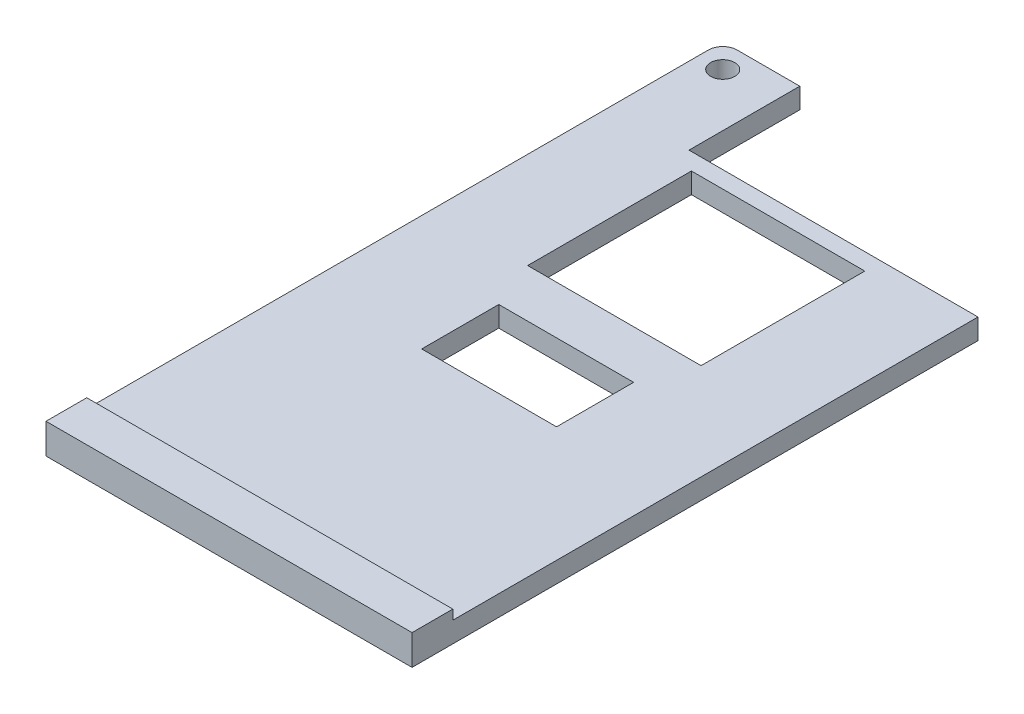
ISO-10303-21;
HEADER;
FILE_DESCRIPTION(('STEP AP214'),'2;1');
FILE_NAME('part.step','',(''),(''),'','','');
FILE_SCHEMA(('AUTOMOTIVE_DESIGN { 1 0 10303 214 1 1 1 1 }'));
ENDSEC;
DATA;
#1=APPLICATION_CONTEXT('core data for automotive mechanical design processes');
#2=APPLICATION_PROTOCOL_DEFINITION('international standard','automotive_design',2000,#1);
#3=PRODUCT_CONTEXT('',#1,'mechanical');
#4=PRODUCT('Part','Part','',(#3));
#5=PRODUCT_RELATED_PRODUCT_CATEGORY('part','',(#4));
#6=PRODUCT_DEFINITION_FORMATION('','',#4);
#7=PRODUCT_DEFINITION_CONTEXT('part definition',#1,'design');
#8=PRODUCT_DEFINITION('design','',#6,#7);
#9=PRODUCT_DEFINITION_SHAPE('','',#8);
#10=(LENGTH_UNIT() NAMED_UNIT(*) SI_UNIT(.MILLI.,.METRE.));
#11=(NAMED_UNIT(*) PLANE_ANGLE_UNIT() SI_UNIT($,.RADIAN.));
#12=(NAMED_UNIT(*) SI_UNIT($,.STERADIAN.) SOLID_ANGLE_UNIT());
#13=UNCERTAINTY_MEASURE_WITH_UNIT(LENGTH_MEASURE(1.E-05),#10,'distance_accuracy_value','');
#14=(GEOMETRIC_REPRESENTATION_CONTEXT(3) GLOBAL_UNCERTAINTY_ASSIGNED_CONTEXT((#13)) GLOBAL_UNIT_ASSIGNED_CONTEXT((#10,
#11,#12)) REPRESENTATION_CONTEXT('',''));
#15=CARTESIAN_POINT('',(0.,0.,0.));
#16=DIRECTION('',(0.,0.,1.));
#17=DIRECTION('',(1.,0.,0.));
#18=AXIS2_PLACEMENT_3D('',#15,#16,#17);
#19=CARTESIAN_POINT('',(36.5,2.13,-88.));
#20=DIRECTION('',(0.,-1.,0.));
#21=DIRECTION('',(0.,0.,-1.));
#22=AXIS2_PLACEMENT_3D('',#19,#20,#21);
#23=PLANE('',#22);
#24=CARTESIAN_POINT('',(2.5,2.13,-87.));
#25=DIRECTION('',(0.,1.,0.));
#26=DIRECTION('',(0.,0.,1.));
#27=AXIS2_PLACEMENT_3D('',#24,#25,#26);
#28=CIRCLE('',#27,1.25);
#29=CARTESIAN_POINT('',(2.5,2.13,-85.75));
#30=VERTEX_POINT('',#29);
#31=EDGE_CURVE('E251',#30,#30,#28,.T.);
#32=ORIENTED_EDGE('',*,*,#31,.F.);
#33=EDGE_LOOP('',(#32));
#34=FACE_BOUND('',#33,.T.);
#35=DIRECTION('',(0.,0.,1.));
#36=VECTOR('',#35,1.);
#37=CARTESIAN_POINT('',(12.,2.13,-46.25));
#38=LINE('',#37,#36);
#39=CARTESIAN_POINT('',(12.,2.13,-54.25));
#40=VERTEX_POINT('',#39);
#41=CARTESIAN_POINT('',(12.,2.13,-46.25));
#42=VERTEX_POINT('',#41);
#43=EDGE_CURVE('E257',#40,#42,#38,.T.);
#44=ORIENTED_EDGE('',*,*,#43,.F.);
#45=DIRECTION('',(-1.,0.,0.));
#46=VECTOR('',#45,1.);
#47=CARTESIAN_POINT('',(12.,2.13,-54.25));
#48=LINE('',#47,#46);
#49=CARTESIAN_POINT('',(26.,2.13,-54.25));
#50=VERTEX_POINT('',#49);
#51=EDGE_CURVE('E265',#50,#40,#48,.T.);
#52=ORIENTED_EDGE('',*,*,#51,.F.);
#53=DIRECTION('',(0.,0.,-1.));
#54=VECTOR('',#53,1.);
#55=CARTESIAN_POINT('',(26.,2.13,-54.25));
#56=LINE('',#55,#54);
#57=CARTESIAN_POINT('',(26.,2.13,-46.25));
#58=VERTEX_POINT('',#57);
#59=EDGE_CURVE('E262',#58,#50,#56,.T.);
#60=ORIENTED_EDGE('',*,*,#59,.F.);
#61=DIRECTION('',(1.,0.,0.));
#62=VECTOR('',#61,1.);
#63=CARTESIAN_POINT('',(26.,2.13,-46.25));
#64=LINE('',#63,#62);
#65=EDGE_CURVE('E259',#42,#58,#64,.T.);
#66=ORIENTED_EDGE('',*,*,#65,.F.);
#67=EDGE_LOOP('',(#44,#52,#60,#66));
#68=FACE_BOUND('',#67,.T.);
#69=DIRECTION('',(0.,0.,1.));
#70=VECTOR('',#69,1.);
#71=CARTESIAN_POINT('',(10.,2.13,-76.25));
#72=LINE('',#71,#70);
#73=CARTESIAN_POINT('',(10.,2.13,-76.25));
#74=VERTEX_POINT('',#73);
#75=CARTESIAN_POINT('',(10.,2.13,-59.25));
#76=VERTEX_POINT('',#75);
#77=EDGE_CURVE('E288',#74,#76,#72,.T.);
#78=ORIENTED_EDGE('',*,*,#77,.F.);
#79=DIRECTION('',(-1.,0.,0.));
#80=VECTOR('',#79,1.);
#81=CARTESIAN_POINT('',(10.,2.13,-76.25));
#82=LINE('',#81,#80);
#83=CARTESIAN_POINT('',(28.,2.13,-76.25));
#84=VERTEX_POINT('',#83);
#85=EDGE_CURVE('E296',#84,#74,#82,.T.);
#86=ORIENTED_EDGE('',*,*,#85,.F.);
#87=DIRECTION('',(0.,0.,-1.));
#88=VECTOR('',#87,1.);
#89=CARTESIAN_POINT('',(28.,2.13,-76.25));
#90=LINE('',#89,#88);
#91=CARTESIAN_POINT('',(28.,2.13,-59.25));
#92=VERTEX_POINT('',#91);
#93=EDGE_CURVE('E293',#92,#84,#90,.T.);
#94=ORIENTED_EDGE('',*,*,#93,.F.);
#95=DIRECTION('',(1.,0.,0.));
#96=VECTOR('',#95,1.);
#97=CARTESIAN_POINT('',(28.,2.13,-59.25));
#98=LINE('',#97,#96);
#99=EDGE_CURVE('E290',#76,#92,#98,.T.);
#100=ORIENTED_EDGE('',*,*,#99,.F.);
#101=EDGE_LOOP('',(#78,#86,#94,#100));
#102=FACE_BOUND('',#101,.T.);
#103=DIRECTION('',(0.,0.,-1.));
#104=VECTOR('',#103,1.);
#105=CARTESIAN_POINT('',(38.,2.13,-19.25));
#106=LINE('',#105,#104);
#107=CARTESIAN_POINT('',(38.,2.13,-23.48));
#108=VERTEX_POINT('',#107);
#109=CARTESIAN_POINT('',(38.,2.13,-78.));
#110=VERTEX_POINT('',#109);
#111=EDGE_CURVE('E196',#108,#110,#106,.T.);
#112=ORIENTED_EDGE('',*,*,#111,.T.);
#113=DIRECTION('',(-1.,0.,0.));
#114=VECTOR('',#113,1.);
#115=CARTESIAN_POINT('',(8.,2.13,-78.));
#116=LINE('',#115,#114);
#117=CARTESIAN_POINT('',(8.,2.13,-78.));
#118=VERTEX_POINT('',#117);
#119=EDGE_CURVE('E63',#110,#118,#116,.T.);
#120=ORIENTED_EDGE('',*,*,#119,.T.);
#121=DIRECTION('',(0.,0.,-1.));
#122=VECTOR('',#121,1.);
#123=CARTESIAN_POINT('',(8.,2.13,-89.5));
#124=LINE('',#123,#122);
#125=CARTESIAN_POINT('',(8.,2.13,-89.5));
#126=VERTEX_POINT('',#125);
#127=EDGE_CURVE('E188',#118,#126,#124,.T.);
#128=ORIENTED_EDGE('',*,*,#127,.T.);
#129=DIRECTION('',(-1.,0.,0.));
#130=VECTOR('',#129,1.);
#131=CARTESIAN_POINT('',(1.50000000000001,2.13,-89.5));
#132=LINE('',#131,#130);
#133=CARTESIAN_POINT('',(1.50000000000001,2.13,-89.5));
#134=VERTEX_POINT('',#133);
#135=EDGE_CURVE('E211',#126,#134,#132,.T.);
#136=ORIENTED_EDGE('',*,*,#135,.T.);
#137=CARTESIAN_POINT('',(1.5,2.13,-88.));
#138=DIRECTION('',(0.,1.,0.));
#139=DIRECTION('',(0.,0.,-1.));
#140=AXIS2_PLACEMENT_3D('',#137,#138,#139);
#141=CIRCLE('',#140,1.5);
#142=CARTESIAN_POINT('',(0.,2.13,-88.));
#143=VERTEX_POINT('',#142);
#144=EDGE_CURVE('E319',#134,#143,#141,.T.);
#145=ORIENTED_EDGE('',*,*,#144,.T.);
#146=DIRECTION('',(0.,0.,1.));
#147=VECTOR('',#146,1.);
#148=CARTESIAN_POINT('',(0.,2.13,-19.25));
#149=LINE('',#148,#147);
#150=CARTESIAN_POINT('',(0.,2.13,-23.48));
#151=VERTEX_POINT('',#150);
#152=EDGE_CURVE('E321',#143,#151,#149,.T.);
#153=ORIENTED_EDGE('',*,*,#152,.T.);
#154=DIRECTION('',(-1.,0.,0.));
#155=VECTOR('',#154,1.);
#156=CARTESIAN_POINT('',(0.,2.13,-23.48));
#157=LINE('',#156,#155);
#158=EDGE_CURVE('E71',#108,#151,#157,.T.);
#159=ORIENTED_EDGE('',*,*,#158,.F.);
#160=EDGE_LOOP('',(#112,#120,#128,#136,#145,#153,#159));
#161=FACE_BOUND('',#160,.T.);
#162=ADVANCED_FACE('F48',(#34,#68,#102,#161),#23,.F.);
#163=CARTESIAN_POINT('',(36.5,0.,-88.));
#164=DIRECTION('',(0.,-1.,0.));
#165=DIRECTION('',(0.,0.,-1.));
#166=AXIS2_PLACEMENT_3D('',#163,#164,#165);
#167=PLANE('',#166);
#168=DIRECTION('',(-1.,0.,0.));
#169=VECTOR('',#168,1.);
#170=CARTESIAN_POINT('',(8.,0.,-78.));
#171=LINE('',#170,#169);
#172=CARTESIAN_POINT('',(38.,0.,-78.));
#173=VERTEX_POINT('',#172);
#174=CARTESIAN_POINT('',(8.,0.,-78.));
#175=VERTEX_POINT('',#174);
#176=EDGE_CURVE('E169',#173,#175,#171,.T.);
#177=ORIENTED_EDGE('',*,*,#176,.F.);
#178=DIRECTION('',(0.,0.,-1.));
#179=VECTOR('',#178,1.);
#180=CARTESIAN_POINT('',(38.,0.,-19.25));
#181=LINE('',#180,#179);
#182=CARTESIAN_POINT('',(38.,0.,-19.25));
#183=VERTEX_POINT('',#182);
#184=EDGE_CURVE('E174',#183,#173,#181,.T.);
#185=ORIENTED_EDGE('',*,*,#184,.F.);
#186=DIRECTION('',(1.,0.,0.));
#187=VECTOR('',#186,1.);
#188=CARTESIAN_POINT('',(0.,0.,-19.25));
#189=LINE('',#188,#187);
#190=CARTESIAN_POINT('',(0.,0.,-19.25));
#191=VERTEX_POINT('',#190);
#192=EDGE_CURVE('E186',#191,#183,#189,.T.);
#193=ORIENTED_EDGE('',*,*,#192,.F.);
#194=DIRECTION('',(0.,0.,1.));
#195=VECTOR('',#194,1.);
#196=CARTESIAN_POINT('',(0.,0.,-19.25));
#197=LINE('',#196,#195);
#198=CARTESIAN_POINT('',(0.,0.,-88.));
#199=VERTEX_POINT('',#198);
#200=EDGE_CURVE('E190',#199,#191,#197,.T.);
#201=ORIENTED_EDGE('',*,*,#200,.F.);
#202=CARTESIAN_POINT('',(1.5,0.,-88.));
#203=DIRECTION('',(0.,1.,0.));
#204=DIRECTION('',(0.,0.,-1.));
#205=AXIS2_PLACEMENT_3D('',#202,#203,#204);
#206=CIRCLE('',#205,1.5);
#207=CARTESIAN_POINT('',(1.50000000000001,0.,-89.5));
#208=VERTEX_POINT('',#207);
#209=EDGE_CURVE('E216',#208,#199,#206,.T.);
#210=ORIENTED_EDGE('',*,*,#209,.F.);
#211=DIRECTION('',(-1.,0.,0.));
#212=VECTOR('',#211,1.);
#213=CARTESIAN_POINT('',(1.50000000000001,0.,-89.5));
#214=LINE('',#213,#212);
#215=CARTESIAN_POINT('',(8.,0.,-89.5));
#216=VERTEX_POINT('',#215);
#217=EDGE_CURVE('E210',#216,#208,#214,.T.);
#218=ORIENTED_EDGE('',*,*,#217,.F.);
#219=DIRECTION('',(0.,0.,-1.));
#220=VECTOR('',#219,1.);
#221=CARTESIAN_POINT('',(8.,0.,-89.5));
#222=LINE('',#221,#220);
#223=EDGE_CURVE('E176',#175,#216,#222,.T.);
#224=ORIENTED_EDGE('',*,*,#223,.F.);
#225=EDGE_LOOP('',(#177,#185,#193,#201,#210,#218,#224));
#226=FACE_BOUND('',#225,.T.);
#227=CARTESIAN_POINT('',(2.5,0.,-87.));
#228=DIRECTION('',(0.,1.,0.));
#229=DIRECTION('',(0.,0.,1.));
#230=AXIS2_PLACEMENT_3D('',#227,#228,#229);
#231=CIRCLE('',#230,1.25);
#232=CARTESIAN_POINT('',(2.5,0.,-85.75));
#233=VERTEX_POINT('',#232);
#234=EDGE_CURVE('E250',#233,#233,#231,.T.);
#235=ORIENTED_EDGE('',*,*,#234,.T.);
#236=EDGE_LOOP('',(#235));
#237=FACE_BOUND('',#236,.T.);
#238=DIRECTION('',(-1.,0.,0.));
#239=VECTOR('',#238,1.);
#240=CARTESIAN_POINT('',(10.,0.,-76.25));
#241=LINE('',#240,#239);
#242=CARTESIAN_POINT('',(28.,0.,-76.25));
#243=VERTEX_POINT('',#242);
#244=CARTESIAN_POINT('',(10.,0.,-76.25));
#245=VERTEX_POINT('',#244);
#246=EDGE_CURVE('E291',#243,#245,#241,.T.);
#247=ORIENTED_EDGE('',*,*,#246,.T.);
#248=DIRECTION('',(0.,0.,1.));
#249=VECTOR('',#248,1.);
#250=CARTESIAN_POINT('',(10.,0.,-76.25));
#251=LINE('',#250,#249);
#252=CARTESIAN_POINT('',(10.,0.,-59.25));
#253=VERTEX_POINT('',#252);
#254=EDGE_CURVE('E287',#245,#253,#251,.T.);
#255=ORIENTED_EDGE('',*,*,#254,.T.);
#256=DIRECTION('',(1.,0.,0.));
#257=VECTOR('',#256,1.);
#258=CARTESIAN_POINT('',(28.,0.,-59.25));
#259=LINE('',#258,#257);
#260=CARTESIAN_POINT('',(28.,0.,-59.25));
#261=VERTEX_POINT('',#260);
#262=EDGE_CURVE('E301',#253,#261,#259,.T.);
#263=ORIENTED_EDGE('',*,*,#262,.T.);
#264=DIRECTION('',(0.,0.,-1.));
#265=VECTOR('',#264,1.);
#266=CARTESIAN_POINT('',(28.,0.,-76.25));
#267=LINE('',#266,#265);
#268=EDGE_CURVE('E304',#261,#243,#267,.T.);
#269=ORIENTED_EDGE('',*,*,#268,.T.);
#270=EDGE_LOOP('',(#247,#255,#263,#269));
#271=FACE_BOUND('',#270,.T.);
#272=DIRECTION('',(-1.,0.,0.));
#273=VECTOR('',#272,1.);
#274=CARTESIAN_POINT('',(12.,0.,-54.25));
#275=LINE('',#274,#273);
#276=CARTESIAN_POINT('',(26.,0.,-54.25));
#277=VERTEX_POINT('',#276);
#278=CARTESIAN_POINT('',(12.,0.,-54.25));
#279=VERTEX_POINT('',#278);
#280=EDGE_CURVE('E260',#277,#279,#275,.T.);
#281=ORIENTED_EDGE('',*,*,#280,.T.);
#282=DIRECTION('',(0.,0.,1.));
#283=VECTOR('',#282,1.);
#284=CARTESIAN_POINT('',(12.,0.,-46.25));
#285=LINE('',#284,#283);
#286=CARTESIAN_POINT('',(12.,0.,-46.25));
#287=VERTEX_POINT('',#286);
#288=EDGE_CURVE('E254',#279,#287,#285,.T.);
#289=ORIENTED_EDGE('',*,*,#288,.T.);
#290=DIRECTION('',(1.,0.,0.));
#291=VECTOR('',#290,1.);
#292=CARTESIAN_POINT('',(26.,0.,-46.25));
#293=LINE('',#292,#291);
#294=CARTESIAN_POINT('',(26.,0.,-46.25));
#295=VERTEX_POINT('',#294);
#296=EDGE_CURVE('E270',#287,#295,#293,.T.);
#297=ORIENTED_EDGE('',*,*,#296,.T.);
#298=DIRECTION('',(0.,0.,-1.));
#299=VECTOR('',#298,1.);
#300=CARTESIAN_POINT('',(26.,0.,-54.25));
#301=LINE('',#300,#299);
#302=EDGE_CURVE('E273',#295,#277,#301,.T.);
#303=ORIENTED_EDGE('',*,*,#302,.T.);
#304=EDGE_LOOP('',(#281,#289,#297,#303));
#305=FACE_BOUND('',#304,.T.);
#306=ADVANCED_FACE('F170',(#226,#237,#271,#305),#167,.T.);
#307=CARTESIAN_POINT('',(8.,2.13,-78.));
#308=DIRECTION('',(0.,0.,1.));
#309=DIRECTION('',(1.,0.,0.));
#310=AXIS2_PLACEMENT_3D('',#307,#308,#309);
#311=PLANE('',#310);
#312=ORIENTED_EDGE('',*,*,#176,.T.);
#313=DIRECTION('',(0.,-1.,0.));
#314=VECTOR('',#313,1.);
#315=CARTESIAN_POINT('',(8.,2.13,-78.));
#316=LINE('',#315,#314);
#317=EDGE_CURVE('E13',#118,#175,#316,.T.);
#318=ORIENTED_EDGE('',*,*,#317,.F.);
#319=ORIENTED_EDGE('',*,*,#119,.F.);
#320=DIRECTION('',(0.,-1.,0.));
#321=VECTOR('',#320,1.);
#322=CARTESIAN_POINT('',(38.,2.13,-78.));
#323=LINE('',#322,#321);
#324=EDGE_CURVE('E179',#110,#173,#323,.T.);
#325=ORIENTED_EDGE('',*,*,#324,.T.);
#326=EDGE_LOOP('',(#312,#318,#319,#325));
#327=FACE_BOUND('',#326,.T.);
#328=ADVANCED_FACE('F50',(#327),#311,.F.);
#329=CARTESIAN_POINT('',(8.,2.13,-89.5));
#330=DIRECTION('',(-1.,0.,0.));
#331=DIRECTION('',(0.,0.,1.));
#332=AXIS2_PLACEMENT_3D('',#329,#330,#331);
#333=PLANE('',#332);
#334=ORIENTED_EDGE('',*,*,#223,.T.);
#335=DIRECTION('',(0.,-1.,0.));
#336=VECTOR('',#335,1.);
#337=CARTESIAN_POINT('',(8.,2.13,-89.5));
#338=LINE('',#337,#336);
#339=EDGE_CURVE('E56',#126,#216,#338,.T.);
#340=ORIENTED_EDGE('',*,*,#339,.F.);
#341=ORIENTED_EDGE('',*,*,#127,.F.);
#342=ORIENTED_EDGE('',*,*,#317,.T.);
#343=EDGE_LOOP('',(#334,#340,#341,#342));
#344=FACE_BOUND('',#343,.T.);
#345=ADVANCED_FACE('F336',(#344),#333,.F.);
#346=CARTESIAN_POINT('',(1.50000000000001,2.13,-89.5));
#347=DIRECTION('',(0.,0.,1.));
#348=DIRECTION('',(1.,0.,0.));
#349=AXIS2_PLACEMENT_3D('',#346,#347,#348);
#350=PLANE('',#349);
#351=ORIENTED_EDGE('',*,*,#217,.T.);
#352=DIRECTION('',(0.,-1.,0.));
#353=VECTOR('',#352,1.);
#354=CARTESIAN_POINT('',(1.50000000000001,2.13,-89.5));
#355=LINE('',#354,#353);
#356=EDGE_CURVE('E202',#134,#208,#355,.T.);
#357=ORIENTED_EDGE('',*,*,#356,.F.);
#358=ORIENTED_EDGE('',*,*,#135,.F.);
#359=ORIENTED_EDGE('',*,*,#339,.T.);
#360=EDGE_LOOP('',(#351,#357,#358,#359));
#361=FACE_BOUND('',#360,.T.);
#362=ADVANCED_FACE('F208',(#361),#350,.F.);
#363=CARTESIAN_POINT('',(1.5,2.13,-88.));
#364=DIRECTION('',(0.,-1.,0.));
#365=DIRECTION('',(0.,0.,-1.));
#366=AXIS2_PLACEMENT_3D('',#363,#364,#365);
#367=CYLINDRICAL_SURFACE('',#366,1.5);
#368=ORIENTED_EDGE('',*,*,#209,.T.);
#369=DIRECTION('',(0.,-1.,0.));
#370=VECTOR('',#369,1.);
#371=CARTESIAN_POINT('',(0.,2.13,-88.));
#372=LINE('',#371,#370);
#373=EDGE_CURVE('E199',#143,#199,#372,.T.);
#374=ORIENTED_EDGE('',*,*,#373,.F.);
#375=ORIENTED_EDGE('',*,*,#144,.F.);
#376=ORIENTED_EDGE('',*,*,#356,.T.);
#377=EDGE_LOOP('',(#368,#374,#375,#376));
#378=FACE_BOUND('',#377,.T.);
#379=ADVANCED_FACE('F328',(#378),#367,.T.);
#380=CARTESIAN_POINT('',(0.,2.13,-19.25));
#381=DIRECTION('',(1.,0.,0.));
#382=DIRECTION('',(0.,0.,-1.));
#383=AXIS2_PLACEMENT_3D('',#380,#381,#382);
#384=PLANE('',#383);
#385=ORIENTED_EDGE('',*,*,#200,.T.);
#386=DIRECTION('',(0.,-1.,0.));
#387=VECTOR('',#386,1.);
#388=CARTESIAN_POINT('',(0.,2.13,-19.25));
#389=LINE('',#388,#387);
#390=CARTESIAN_POINT('',(0.,3.13,-19.25));
#391=VERTEX_POINT('',#390);
#392=EDGE_CURVE('E195',#391,#191,#389,.T.);
#393=ORIENTED_EDGE('',*,*,#392,.F.);
#394=DIRECTION('',(0.,0.,1.));
#395=VECTOR('',#394,1.);
#396=CARTESIAN_POINT('',(0.,3.13,-19.25));
#397=LINE('',#396,#395);
#398=CARTESIAN_POINT('',(0.,3.13,-23.48));
#399=VERTEX_POINT('',#398);
#400=EDGE_CURVE('E233',#399,#391,#397,.T.);
#401=ORIENTED_EDGE('',*,*,#400,.F.);
#402=DIRECTION('',(0.,-1.,0.));
#403=VECTOR('',#402,1.);
#404=CARTESIAN_POINT('',(0.,3.13,-23.48));
#405=LINE('',#404,#403);
#406=EDGE_CURVE('E244',#399,#151,#405,.T.);
#407=ORIENTED_EDGE('',*,*,#406,.T.);
#408=ORIENTED_EDGE('',*,*,#152,.F.);
#409=ORIENTED_EDGE('',*,*,#373,.T.);
#410=EDGE_LOOP('',(#385,#393,#401,#407,#408,#409));
#411=FACE_BOUND('',#410,.T.);
#412=ADVANCED_FACE('F221',(#411),#384,.F.);
#413=CARTESIAN_POINT('',(0.,2.13,-19.25));
#414=DIRECTION('',(0.,0.,-1.));
#415=DIRECTION('',(-1.,0.,0.));
#416=AXIS2_PLACEMENT_3D('',#413,#414,#415);
#417=PLANE('',#416);
#418=ORIENTED_EDGE('',*,*,#192,.T.);
#419=DIRECTION('',(0.,-1.,0.));
#420=VECTOR('',#419,1.);
#421=CARTESIAN_POINT('',(38.,2.13,-19.25));
#422=LINE('',#421,#420);
#423=CARTESIAN_POINT('',(38.,3.13,-19.25));
#424=VERTEX_POINT('',#423);
#425=EDGE_CURVE('E185',#424,#183,#422,.T.);
#426=ORIENTED_EDGE('',*,*,#425,.F.);
#427=DIRECTION('',(1.,0.,0.));
#428=VECTOR('',#427,1.);
#429=CARTESIAN_POINT('',(0.,3.13,-19.25));
#430=LINE('',#429,#428);
#431=EDGE_CURVE('E229',#391,#424,#430,.T.);
#432=ORIENTED_EDGE('',*,*,#431,.F.);
#433=ORIENTED_EDGE('',*,*,#392,.T.);
#434=EDGE_LOOP('',(#418,#426,#432,#433));
#435=FACE_BOUND('',#434,.T.);
#436=ADVANCED_FACE('F227',(#435),#417,.F.);
#437=CARTESIAN_POINT('',(38.,2.13,-19.25));
#438=DIRECTION('',(-1.,0.,0.));
#439=DIRECTION('',(0.,0.,1.));
#440=AXIS2_PLACEMENT_3D('',#437,#438,#439);
#441=PLANE('',#440);
#442=ORIENTED_EDGE('',*,*,#184,.T.);
#443=ORIENTED_EDGE('',*,*,#324,.F.);
#444=ORIENTED_EDGE('',*,*,#111,.F.);
#445=DIRECTION('',(0.,-1.,0.));
#446=VECTOR('',#445,1.);
#447=CARTESIAN_POINT('',(38.,3.13,-23.48));
#448=LINE('',#447,#446);
#449=CARTESIAN_POINT('',(38.,3.13,-23.48));
#450=VERTEX_POINT('',#449);
#451=EDGE_CURVE('E247',#450,#108,#448,.T.);
#452=ORIENTED_EDGE('',*,*,#451,.F.);
#453=DIRECTION('',(0.,0.,-1.));
#454=VECTOR('',#453,1.);
#455=CARTESIAN_POINT('',(38.,3.13,-19.25));
#456=LINE('',#455,#454);
#457=EDGE_CURVE('E232',#424,#450,#456,.T.);
#458=ORIENTED_EDGE('',*,*,#457,.F.);
#459=ORIENTED_EDGE('',*,*,#425,.T.);
#460=EDGE_LOOP('',(#442,#443,#444,#452,#458,#459));
#461=FACE_BOUND('',#460,.T.);
#462=ADVANCED_FACE('F183',(#461),#441,.F.);
#463=CARTESIAN_POINT('',(10.,2.13,-76.25));
#464=DIRECTION('',(1.,0.,0.));
#465=DIRECTION('',(0.,0.,-1.));
#466=AXIS2_PLACEMENT_3D('',#463,#464,#465);
#467=PLANE('',#466);
#468=ORIENTED_EDGE('',*,*,#254,.F.);
#469=DIRECTION('',(0.,-1.,0.));
#470=VECTOR('',#469,1.);
#471=CARTESIAN_POINT('',(10.,2.13,-76.25));
#472=LINE('',#471,#470);
#473=EDGE_CURVE('E298',#74,#245,#472,.T.);
#474=ORIENTED_EDGE('',*,*,#473,.F.);
#475=ORIENTED_EDGE('',*,*,#77,.T.);
#476=DIRECTION('',(0.,-1.,0.));
#477=VECTOR('',#476,1.);
#478=CARTESIAN_POINT('',(10.,2.13,-59.25));
#479=LINE('',#478,#477);
#480=EDGE_CURVE('E177',#76,#253,#479,.T.);
#481=ORIENTED_EDGE('',*,*,#480,.T.);
#482=EDGE_LOOP('',(#468,#474,#475,#481));
#483=FACE_BOUND('',#482,.T.);
#484=ADVANCED_FACE('F348',(#483),#467,.T.);
#485=CARTESIAN_POINT('',(28.,2.13,-59.25));
#486=DIRECTION('',(0.,0.,-1.));
#487=DIRECTION('',(-1.,0.,0.));
#488=AXIS2_PLACEMENT_3D('',#485,#486,#487);
#489=PLANE('',#488);
#490=ORIENTED_EDGE('',*,*,#262,.F.);
#491=ORIENTED_EDGE('',*,*,#480,.F.);
#492=ORIENTED_EDGE('',*,*,#99,.T.);
#493=DIRECTION('',(0.,-1.,0.));
#494=VECTOR('',#493,1.);
#495=CARTESIAN_POINT('',(28.,2.13,-59.25));
#496=LINE('',#495,#494);
#497=EDGE_CURVE('E313',#92,#261,#496,.T.);
#498=ORIENTED_EDGE('',*,*,#497,.T.);
#499=EDGE_LOOP('',(#490,#491,#492,#498));
#500=FACE_BOUND('',#499,.T.);
#501=ADVANCED_FACE('F371',(#500),#489,.T.);
#502=CARTESIAN_POINT('',(28.,2.13,-76.25));
#503=DIRECTION('',(-1.,0.,0.));
#504=DIRECTION('',(0.,0.,1.));
#505=AXIS2_PLACEMENT_3D('',#502,#503,#504);
#506=PLANE('',#505);
#507=ORIENTED_EDGE('',*,*,#268,.F.);
#508=ORIENTED_EDGE('',*,*,#497,.F.);
#509=ORIENTED_EDGE('',*,*,#93,.T.);
#510=DIRECTION('',(0.,-1.,0.));
#511=VECTOR('',#510,1.);
#512=CARTESIAN_POINT('',(28.,2.13,-76.25));
#513=LINE('',#512,#511);
#514=EDGE_CURVE('E311',#84,#243,#513,.T.);
#515=ORIENTED_EDGE('',*,*,#514,.T.);
#516=EDGE_LOOP('',(#507,#508,#509,#515));
#517=FACE_BOUND('',#516,.T.);
#518=ADVANCED_FACE('F378',(#517),#506,.T.);
#519=CARTESIAN_POINT('',(10.,2.13,-76.25));
#520=DIRECTION('',(0.,0.,1.));
#521=DIRECTION('',(1.,0.,0.));
#522=AXIS2_PLACEMENT_3D('',#519,#520,#521);
#523=PLANE('',#522);
#524=ORIENTED_EDGE('',*,*,#246,.F.);
#525=ORIENTED_EDGE('',*,*,#514,.F.);
#526=ORIENTED_EDGE('',*,*,#85,.T.);
#527=ORIENTED_EDGE('',*,*,#473,.T.);
#528=EDGE_LOOP('',(#524,#525,#526,#527));
#529=FACE_BOUND('',#528,.T.);
#530=ADVANCED_FACE('F385',(#529),#523,.T.);
#531=CARTESIAN_POINT('',(12.,2.13,-46.25));
#532=DIRECTION('',(1.,0.,0.));
#533=DIRECTION('',(0.,0.,-1.));
#534=AXIS2_PLACEMENT_3D('',#531,#532,#533);
#535=PLANE('',#534);
#536=ORIENTED_EDGE('',*,*,#288,.F.);
#537=DIRECTION('',(0.,-1.,0.));
#538=VECTOR('',#537,1.);
#539=CARTESIAN_POINT('',(12.,2.13,-54.25));
#540=LINE('',#539,#538);
#541=EDGE_CURVE('E267',#40,#279,#540,.T.);
#542=ORIENTED_EDGE('',*,*,#541,.F.);
#543=ORIENTED_EDGE('',*,*,#43,.T.);
#544=DIRECTION('',(0.,-1.,0.));
#545=VECTOR('',#544,1.);
#546=CARTESIAN_POINT('',(12.,2.13,-46.25));
#547=LINE('',#546,#545);
#548=EDGE_CURVE('E284',#42,#287,#547,.T.);
#549=ORIENTED_EDGE('',*,*,#548,.T.);
#550=EDGE_LOOP('',(#536,#542,#543,#549));
#551=FACE_BOUND('',#550,.T.);
#552=ADVANCED_FACE('F393',(#551),#535,.T.);
#553=CARTESIAN_POINT('',(26.,2.13,-46.25));
#554=DIRECTION('',(0.,0.,-1.));
#555=DIRECTION('',(-1.,0.,0.));
#556=AXIS2_PLACEMENT_3D('',#553,#554,#555);
#557=PLANE('',#556);
#558=ORIENTED_EDGE('',*,*,#296,.F.);
#559=ORIENTED_EDGE('',*,*,#548,.F.);
#560=ORIENTED_EDGE('',*,*,#65,.T.);
#561=DIRECTION('',(0.,-1.,0.));
#562=VECTOR('',#561,1.);
#563=CARTESIAN_POINT('',(26.,2.13,-46.25));
#564=LINE('',#563,#562);
#565=EDGE_CURVE('E282',#58,#295,#564,.T.);
#566=ORIENTED_EDGE('',*,*,#565,.T.);
#567=EDGE_LOOP('',(#558,#559,#560,#566));
#568=FACE_BOUND('',#567,.T.);
#569=ADVANCED_FACE('F401',(#568),#557,.T.);
#570=CARTESIAN_POINT('',(26.,2.13,-54.25));
#571=DIRECTION('',(-1.,0.,0.));
#572=DIRECTION('',(0.,0.,1.));
#573=AXIS2_PLACEMENT_3D('',#570,#571,#572);
#574=PLANE('',#573);
#575=ORIENTED_EDGE('',*,*,#302,.F.);
#576=ORIENTED_EDGE('',*,*,#565,.F.);
#577=ORIENTED_EDGE('',*,*,#59,.T.);
#578=DIRECTION('',(0.,-1.,0.));
#579=VECTOR('',#578,1.);
#580=CARTESIAN_POINT('',(26.,2.13,-54.25));
#581=LINE('',#580,#579);
#582=EDGE_CURVE('E280',#50,#277,#581,.T.);
#583=ORIENTED_EDGE('',*,*,#582,.T.);
#584=EDGE_LOOP('',(#575,#576,#577,#583));
#585=FACE_BOUND('',#584,.T.);
#586=ADVANCED_FACE('F409',(#585),#574,.T.);
#587=CARTESIAN_POINT('',(12.,2.13,-54.25));
#588=DIRECTION('',(0.,0.,1.));
#589=DIRECTION('',(1.,0.,0.));
#590=AXIS2_PLACEMENT_3D('',#587,#588,#589);
#591=PLANE('',#590);
#592=ORIENTED_EDGE('',*,*,#280,.F.);
#593=ORIENTED_EDGE('',*,*,#582,.F.);
#594=ORIENTED_EDGE('',*,*,#51,.T.);
#595=ORIENTED_EDGE('',*,*,#541,.T.);
#596=EDGE_LOOP('',(#592,#593,#594,#595));
#597=FACE_BOUND('',#596,.T.);
#598=ADVANCED_FACE('F417',(#597),#591,.T.);
#599=CARTESIAN_POINT('',(2.5,2.13,-87.));
#600=DIRECTION('',(0.,-1.,0.));
#601=DIRECTION('',(0.,0.,-1.));
#602=AXIS2_PLACEMENT_3D('',#599,#600,#601);
#603=CYLINDRICAL_SURFACE('',#602,1.25);
#604=ORIENTED_EDGE('',*,*,#31,.T.);
#605=EDGE_LOOP('',(#604));
#606=FACE_BOUND('',#605,.T.);
#607=ORIENTED_EDGE('',*,*,#234,.F.);
#608=EDGE_LOOP('',(#607));
#609=FACE_BOUND('',#608,.T.);
#610=ADVANCED_FACE('F425',(#606,#609),#603,.F.);
#611=CARTESIAN_POINT('',(0.,3.13,-23.48));
#612=DIRECTION('',(0.,0.,1.));
#613=DIRECTION('',(1.,0.,0.));
#614=AXIS2_PLACEMENT_3D('',#611,#612,#613);
#615=PLANE('',#614);
#616=ORIENTED_EDGE('',*,*,#158,.T.);
#617=ORIENTED_EDGE('',*,*,#406,.F.);
#618=DIRECTION('',(-1.,0.,0.));
#619=VECTOR('',#618,1.);
#620=CARTESIAN_POINT('',(0.,3.13,-23.48));
#621=LINE('',#620,#619);
#622=EDGE_CURVE('E237',#450,#399,#621,.T.);
#623=ORIENTED_EDGE('',*,*,#622,.F.);
#624=ORIENTED_EDGE('',*,*,#451,.T.);
#625=EDGE_LOOP('',(#616,#617,#623,#624));
#626=FACE_BOUND('',#625,.T.);
#627=ADVANCED_FACE('F325',(#626),#615,.F.);
#628=CARTESIAN_POINT('',(0.,3.13,0.));
#629=DIRECTION('',(0.,-1.,0.));
#630=DIRECTION('',(0.,0.,-1.));
#631=AXIS2_PLACEMENT_3D('',#628,#629,#630);
#632=PLANE('',#631);
#633=ORIENTED_EDGE('',*,*,#400,.T.);
#634=ORIENTED_EDGE('',*,*,#431,.T.);
#635=ORIENTED_EDGE('',*,*,#457,.T.);
#636=ORIENTED_EDGE('',*,*,#622,.T.);
#637=EDGE_LOOP('',(#633,#634,#635,#636));
#638=FACE_BOUND('',#637,.T.);
#639=ADVANCED_FACE('F235',(#638),#632,.F.);
#640=CLOSED_SHELL('',(#162,#306,#328,#345,#362,#379,#412,#436,#462,#484,#501,#518,#530,#552,
#569,#586,#598,#610,#627,#639));
#641=MANIFOLD_SOLID_BREP('B2',#640);
#642=ADVANCED_BREP_SHAPE_REPRESENTATION('',(#18,#641),#14);
#643=SHAPE_DEFINITION_REPRESENTATION(#9,#642);
ENDSEC;
END-ISO-10303-21;
